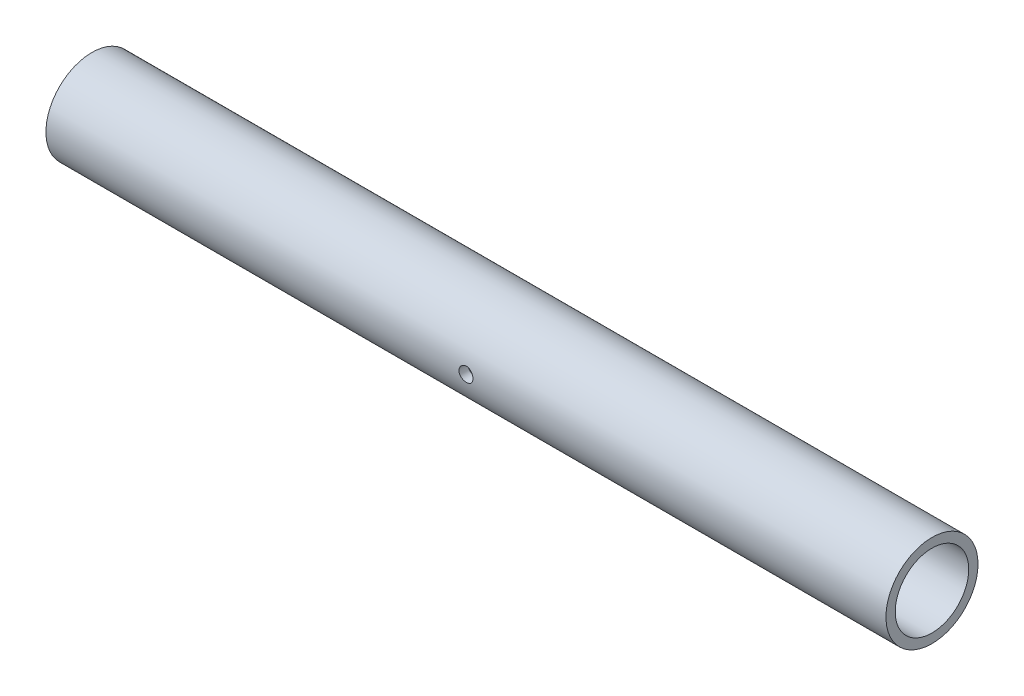
ISO-10303-21;
HEADER;
FILE_DESCRIPTION(('STEP AP214'),'2;1');
FILE_NAME('part.step','',(''),(''),'','','');
FILE_SCHEMA(('AUTOMOTIVE_DESIGN { 1 0 10303 214 1 1 1 1 }'));
ENDSEC;
DATA;
#1=APPLICATION_CONTEXT('core data for automotive mechanical design processes');
#2=APPLICATION_PROTOCOL_DEFINITION('international standard','automotive_design',2000,#1);
#3=PRODUCT_CONTEXT('',#1,'mechanical');
#4=PRODUCT('Part','Part','',(#3));
#5=PRODUCT_RELATED_PRODUCT_CATEGORY('part','',(#4));
#6=PRODUCT_DEFINITION_FORMATION('','',#4);
#7=PRODUCT_DEFINITION_CONTEXT('part definition',#1,'design');
#8=PRODUCT_DEFINITION('design','',#6,#7);
#9=PRODUCT_DEFINITION_SHAPE('','',#8);
#10=(LENGTH_UNIT() NAMED_UNIT(*) SI_UNIT(.MILLI.,.METRE.));
#11=(NAMED_UNIT(*) PLANE_ANGLE_UNIT() SI_UNIT($,.RADIAN.));
#12=(NAMED_UNIT(*) SI_UNIT($,.STERADIAN.) SOLID_ANGLE_UNIT());
#13=UNCERTAINTY_MEASURE_WITH_UNIT(LENGTH_MEASURE(1.E-05),#10,'distance_accuracy_value','');
#14=(GEOMETRIC_REPRESENTATION_CONTEXT(3) GLOBAL_UNCERTAINTY_ASSIGNED_CONTEXT((#13)) GLOBAL_UNIT_ASSIGNED_CONTEXT((#10,
#11,#12)) REPRESENTATION_CONTEXT('',''));
#15=CARTESIAN_POINT('',(0.,0.,0.));
#16=DIRECTION('',(0.,0.,1.));
#17=DIRECTION('',(1.,0.,0.));
#18=AXIS2_PLACEMENT_3D('',#15,#16,#17);
#19=CARTESIAN_POINT('',(304.8,0.,0.));
#20=DIRECTION('',(1.,0.,0.));
#21=DIRECTION('',(0.,0.,-1.));
#22=AXIS2_PLACEMENT_3D('',#19,#20,#21);
#23=PLANE('',#22);
#24=CARTESIAN_POINT('',(304.8,0.,0.));
#25=DIRECTION('',(1.,0.,0.));
#26=DIRECTION('',(0.,0.,-1.));
#27=AXIS2_PLACEMENT_3D('',#24,#25,#26);
#28=CIRCLE('',#27,16.7005);
#29=CARTESIAN_POINT('',(304.8,0.,-16.7005));
#30=VERTEX_POINT('',#29);
#31=EDGE_CURVE('E10',#30,#30,#28,.T.);
#32=ORIENTED_EDGE('',*,*,#31,.T.);
#33=EDGE_LOOP('',(#32));
#34=FACE_BOUND('',#33,.T.);
#35=CARTESIAN_POINT('',(304.8,0.,0.));
#36=DIRECTION('',(1.,0.,0.));
#37=DIRECTION('',(0.,0.,-1.));
#38=AXIS2_PLACEMENT_3D('',#35,#36,#37);
#39=CIRCLE('',#38,13.335);
#40=CARTESIAN_POINT('',(304.8,0.,-13.335));
#41=VERTEX_POINT('',#40);
#42=EDGE_CURVE('E44',#41,#41,#39,.T.);
#43=ORIENTED_EDGE('',*,*,#42,.F.);
#44=EDGE_LOOP('',(#43));
#45=FACE_BOUND('',#44,.T.);
#46=ADVANCED_FACE('F32',(#34,#45),#23,.T.);
#47=CARTESIAN_POINT('',(0.,0.,0.));
#48=DIRECTION('',(1.,0.,0.));
#49=DIRECTION('',(0.,0.,-1.));
#50=AXIS2_PLACEMENT_3D('',#47,#48,#49);
#51=PLANE('',#50);
#52=CARTESIAN_POINT('',(0.,0.,0.));
#53=DIRECTION('',(1.,0.,0.));
#54=DIRECTION('',(0.,0.,-1.));
#55=AXIS2_PLACEMENT_3D('',#52,#53,#54);
#56=CIRCLE('',#55,16.7005);
#57=CARTESIAN_POINT('',(0.,0.,-16.7005));
#58=VERTEX_POINT('',#57);
#59=EDGE_CURVE('E37',#58,#58,#56,.T.);
#60=ORIENTED_EDGE('',*,*,#59,.F.);
#61=EDGE_LOOP('',(#60));
#62=FACE_BOUND('',#61,.T.);
#63=CARTESIAN_POINT('',(0.,0.,0.));
#64=DIRECTION('',(1.,0.,0.));
#65=DIRECTION('',(0.,0.,-1.));
#66=AXIS2_PLACEMENT_3D('',#63,#64,#65);
#67=CIRCLE('',#66,13.335);
#68=CARTESIAN_POINT('',(0.,0.,-13.335));
#69=VERTEX_POINT('',#68);
#70=EDGE_CURVE('E46',#69,#69,#67,.T.);
#71=ORIENTED_EDGE('',*,*,#70,.T.);
#72=EDGE_LOOP('',(#71));
#73=FACE_BOUND('',#72,.T.);
#74=ADVANCED_FACE('F73',(#62,#73),#51,.F.);
#75=CARTESIAN_POINT('',(304.8,0.,0.));
#76=DIRECTION('',(-1.,0.,0.));
#77=DIRECTION('',(0.,0.,1.));
#78=AXIS2_PLACEMENT_3D('',#75,#76,#77);
#79=CYLINDRICAL_SURFACE('',#78,16.7005);
#80=CARTESIAN_POINT('',(154.9527,0.,16.7005));
#81=CARTESIAN_POINT('',(154.952694148685,-0.142495741614808,16.7004976867134));
#82=CARTESIAN_POINT('',(154.940728209795,-0.285073362780954,16.698657155009));
#83=CARTESIAN_POINT('',(154.893194005577,-0.56624111882846,16.6914920623086));
#84=CARTESIAN_POINT('',(154.857602968243,-0.704827271765602,16.6861641399192));
#85=CARTESIAN_POINT('',(154.763908768856,-0.973902530812743,16.6726228172328));
#86=CARTESIAN_POINT('',(154.705822852533,-1.10439775115164,16.6644116278452));
#87=CARTESIAN_POINT('',(154.568830390964,-1.35376975931313,16.646010367155));
#88=CARTESIAN_POINT('',(154.489926653192,-1.47264811081689,16.6358205627356));
#89=CARTESIAN_POINT('',(154.312857595302,-1.69639408857641,16.6145023453034));
#90=CARTESIAN_POINT('',(154.21455689291,-1.80115398997693,16.6033676680795));
#91=CARTESIAN_POINT('',(154.001775649134,-1.99275970465777,16.5814635036606));
#92=CARTESIAN_POINT('',(153.887294163435,-2.0796044716776,16.5706940378251));
#93=CARTESIAN_POINT('',(153.644674563623,-2.23333612031372,16.5506788932135));
#94=CARTESIAN_POINT('',(153.516469439897,-2.30011839277781,16.5414413101584));
#95=CARTESIAN_POINT('',(153.250497230487,-2.41116076239233,16.5256216036892));
#96=CARTESIAN_POINT('',(153.112730686691,-2.45542213471663,16.5190393299311));
#97=CARTESIAN_POINT('',(152.832680790303,-2.51983092083288,16.5093372261092));
#98=CARTESIAN_POINT('',(152.690440849797,-2.54016302478408,16.506190890695));
#99=CARTESIAN_POINT('',(152.404535970859,-2.55670835239973,16.5036364826265));
#100=CARTESIAN_POINT('',(152.260871117857,-2.55292301338208,16.5042281871976));
#101=CARTESIAN_POINT('',(151.977501449171,-2.52149175759947,16.5090587727699));
#102=CARTESIAN_POINT('',(151.837773171075,-2.49405182967903,16.5132661666504));
#103=CARTESIAN_POINT('',(151.564927551711,-2.41641290291032,16.524804859706));
#104=CARTESIAN_POINT('',(151.431810404146,-2.3662132376526,16.5321362503519));
#105=CARTESIAN_POINT('',(151.175340673029,-2.24426646671191,16.5491315276713));
#106=CARTESIAN_POINT('',(151.052030089225,-2.17243239142541,16.5588047972422));
#107=CARTESIAN_POINT('',(150.81913492146,-2.00931781222802,16.5793871607617));
#108=CARTESIAN_POINT('',(150.709551273203,-1.91803598379362,16.5902963388604));
#109=CARTESIAN_POINT('',(150.506027059983,-1.71748772277903,16.6122603243169));
#110=CARTESIAN_POINT('',(150.412260897622,-1.60804424725734,16.6233154669077));
#111=CARTESIAN_POINT('',(150.244399876039,-1.37488203669379,16.6442205373115));
#112=CARTESIAN_POINT('',(150.170305109048,-1.25116323472562,16.6540704594736));
#113=CARTESIAN_POINT('',(150.043880059519,-0.992809023919818,16.6714661376094));
#114=CARTESIAN_POINT('',(149.991563552695,-0.858166769651909,16.6790104343736));
#115=CARTESIAN_POINT('',(149.910333391368,-0.581866429234559,16.6909327089944));
#116=CARTESIAN_POINT('',(149.881418093387,-0.440208836517879,16.6953109092055));
#117=CARTESIAN_POINT('',(149.84804379727,-0.15540384328218,16.7003781628502));
#118=CARTESIAN_POINT('',(149.843345088552,-0.0122851525849659,16.7011033741657));
#119=CARTESIAN_POINT('',(149.857900622412,0.272696097261191,16.6988814632555));
#120=CARTESIAN_POINT('',(149.877154094136,0.414558696686981,16.6959344592128));
#121=CARTESIAN_POINT('',(149.938868112366,0.692272367132334,16.6867216116966));
#122=CARTESIAN_POINT('',(149.981211563134,0.828150062791593,16.6804725189497));
#123=CARTESIAN_POINT('',(150.08777986095,1.09087755943283,16.6653538164498));
#124=CARTESIAN_POINT('',(150.152005769528,1.21772692208387,16.6564840795706));
#125=CARTESIAN_POINT('',(150.301076026137,1.45984892681212,16.6370196365877));
#126=CARTESIAN_POINT('',(150.386072051791,1.57502716085383,16.6264124393314));
#127=CARTESIAN_POINT('',(150.574059059338,1.78957030044293,16.6046917393545));
#128=CARTESIAN_POINT('',(150.677051129439,1.88893424901711,16.5935782060463));
#129=CARTESIAN_POINT('',(150.899175137503,2.06990315113865,16.5719823718543));
#130=CARTESIAN_POINT('',(151.018438869227,2.15134720389298,16.5615063563669));
#131=CARTESIAN_POINT('',(151.269095043549,2.29304514159802,16.5424840027995));
#132=CARTESIAN_POINT('',(151.400487148527,2.35329961618331,16.5339376110269));
#133=CARTESIAN_POINT('',(151.671195450696,2.45066004328359,16.5197879354036));
#134=CARTESIAN_POINT('',(151.810480884563,2.4878499149827,16.5141739939145));
#135=CARTESIAN_POINT('',(152.093413173411,2.53829207476794,16.5064967707241));
#136=CARTESIAN_POINT('',(152.237059713836,2.55154608513676,16.5044332335573));
#137=CARTESIAN_POINT('',(152.523032407778,2.55369815360237,16.5041002435876));
#138=CARTESIAN_POINT('',(152.665356675606,2.54284924350765,16.5057913742589));
#139=CARTESIAN_POINT('',(152.946130923917,2.49764646979545,16.5126913892346));
#140=CARTESIAN_POINT('',(153.084580911575,2.46329264971225,16.5179002670237));
#141=CARTESIAN_POINT('',(153.353601826018,2.37214595380091,16.5312348886822));
#142=CARTESIAN_POINT('',(153.484179099745,2.31537143996926,16.5393582451685));
#143=CARTESIAN_POINT('',(153.733995981226,2.18102027316627,16.5576093287388));
#144=CARTESIAN_POINT('',(153.853235175235,2.1034428614564,16.5677371289268));
#145=CARTESIAN_POINT('',(154.078275553688,1.92877138400066,16.5889823953652));
#146=CARTESIAN_POINT('',(154.183930610837,1.83149011012819,16.6001087367033));
#147=CARTESIAN_POINT('',(154.377505811123,1.6205680011597,16.6220238827646));
#148=CARTESIAN_POINT('',(154.465421832014,1.50692337399104,16.6328126085407));
#149=CARTESIAN_POINT('',(154.621475099668,1.26573322100042,16.6529077042466));
#150=CARTESIAN_POINT('',(154.689496175157,1.13811180318665,16.662205229733));
#151=CARTESIAN_POINT('',(154.803034775807,0.873171990993248,16.6781837699746));
#152=CARTESIAN_POINT('',(154.848575461957,0.735863744164259,16.6848674762014));
#153=CARTESIAN_POINT('',(154.905602009183,0.498293942562698,16.6933505985302));
#154=CARTESIAN_POINT('',(154.923236553761,0.399494249657639,16.6960177634322));
#155=CARTESIAN_POINT('',(154.946787530569,0.200476536562219,16.6995932664026));
#156=CARTESIAN_POINT('',(154.952704116925,0.100258535044429,16.7005016276046));
#157=CARTESIAN_POINT('',(154.9527,0.,16.7005));
#158=B_SPLINE_CURVE_WITH_KNOTS('',3,(#80,#81,#82,#83,#84,#85,#86,#87,#88,#89,#90,#91,#92,#93,
#94,#95,#96,#97,#98,#99,#100,#101,#102,#103,#104,#105,#106,#107,#108,#109,#110,#111,#112,#113,
#114,#115,#116,#117,#118,#119,#120,#121,#122,#123,#124,#125,#126,#127,#128,#129,#130,#131,#132,
#133,#134,#135,#136,#137,#138,#139,#140,#141,#142,#143,#144,#145,#146,#147,#148,#149,#150,#151,
#152,#153,#154,#155,#156,#157),.UNSPECIFIED.,.T.,.F.,(4,2,2,2,2,2,2,2,2,2,2,2,2,2,2,2,2,2,2,2,2,
2,2,2,2,2,2,2,2,2,2,2,2,2,2,2,2,2,4),(0.,0.427120850123167,0.854653996926453,1.28186002165463,
1.70900846315275,2.13925097672643,2.56951860975402,3.00199227159855,3.43444144328115,
3.86353054233216,4.29259406936566,4.71795854161827,5.14333546942823,5.57044575550799,
5.99758513999142,6.4291634842538,6.86074385194585,7.29259679998682,7.72441941612234,
8.15195926429043,8.57948535328662,9.00486323287765,9.43026175074956,9.85886487116816,
10.2874939178853,10.7198273230551,11.1521486968905,11.5828877223658,12.0135957531794,
12.4398036098952,12.8660106772182,13.2918694129212,13.7177436829692,14.147871938876,
14.5781000343813,15.0107923508466,15.443037939831,15.743559720296,16.0440775479518),.UNSPECIFIED.);
#159=CARTESIAN_POINT('',(154.9527,0.,16.7005));
#160=VERTEX_POINT('',#159);
#161=EDGE_CURVE('E49',#160,#160,#158,.T.);
#162=ORIENTED_EDGE('',*,*,#161,.T.);
#163=EDGE_LOOP('',(#162));
#164=FACE_BOUND('',#163,.T.);
#165=ORIENTED_EDGE('',*,*,#31,.F.);
#166=EDGE_LOOP('',(#165));
#167=FACE_BOUND('',#166,.T.);
#168=ORIENTED_EDGE('',*,*,#59,.T.);
#169=EDGE_LOOP('',(#168));
#170=FACE_BOUND('',#169,.T.);
#171=ADVANCED_FACE('F34',(#164,#167,#170),#79,.T.);
#172=CARTESIAN_POINT('',(304.8,0.,0.));
#173=DIRECTION('',(-1.,0.,0.));
#174=DIRECTION('',(0.,0.,1.));
#175=AXIS2_PLACEMENT_3D('',#172,#173,#174);
#176=CYLINDRICAL_SURFACE('',#175,13.335);
#177=CARTESIAN_POINT('',(154.9527,0.,13.335));
#178=CARTESIAN_POINT('',(154.952694633969,-0.141996506763978,13.3349974108733));
#179=CARTESIAN_POINT('',(154.940811916449,-0.284062211548814,13.3327085704285));
#180=CARTESIAN_POINT('',(154.893627805119,-0.564186510046626,13.3237985935968));
#181=CARTESIAN_POINT('',(154.858307003428,-0.702241683874888,13.3171738669461));
#182=CARTESIAN_POINT('',(154.765370941577,-0.970253538037561,13.3003327731445));
#183=CARTESIAN_POINT('',(154.707776192586,-1.10021754174126,13.2901197111347));
#184=CARTESIAN_POINT('',(154.571986211121,-1.34862666841281,13.2672156603168));
#185=CARTESIAN_POINT('',(154.493792509817,-1.46707264664783,13.2545248557035));
#186=CARTESIAN_POINT('',(154.317990526751,-1.69057022244865,13.2278880534064));
#187=CARTESIAN_POINT('',(154.220175319793,-1.79545758937839,13.213929628508));
#188=CARTESIAN_POINT('',(154.008351972904,-1.98743941735015,13.1864224572463));
#189=CARTESIAN_POINT('',(153.894342640317,-2.07453256673938,13.1728737411462));
#190=CARTESIAN_POINT('',(153.652200334093,-2.2291416999098,13.1475990622031));
#191=CARTESIAN_POINT('',(153.523958282867,-2.29648969944411,13.1358891122937));
#192=CARTESIAN_POINT('',(153.257718022459,-2.40862115810106,13.115793345128));
#193=CARTESIAN_POINT('',(153.119720693318,-2.45340664967142,13.1074072284727));
#194=CARTESIAN_POINT('',(152.839647393008,-2.51861284372904,13.0950339182917));
#195=CARTESIAN_POINT('',(152.697640561605,-2.53932049608294,13.0909949611783));
#196=CARTESIAN_POINT('',(152.412115150598,-2.55667406430123,13.0876172920902));
#197=CARTESIAN_POINT('',(152.268596713637,-2.55332223058332,13.0882781405163));
#198=CARTESIAN_POINT('',(151.986207246722,-2.52288444363947,13.0941783166969));
#199=CARTESIAN_POINT('',(151.847299445034,-2.4961255990724,13.0993545401827));
#200=CARTESIAN_POINT('',(151.575981866996,-2.42014888618961,13.1136030422845));
#201=CARTESIAN_POINT('',(151.443572377627,-2.37093002697313,13.1226754927947));
#202=CARTESIAN_POINT('',(151.188057380545,-2.2511128596095,13.1437597327899));
#203=CARTESIAN_POINT('',(151.065015002077,-2.18038321807219,13.1557894889995));
#204=CARTESIAN_POINT('',(150.832422052206,-2.01964505648578,13.1814211169073));
#205=CARTESIAN_POINT('',(150.722872907952,-1.92963449989332,13.1950231546076));
#206=CARTESIAN_POINT('',(150.518486927355,-1.73112971738714,13.2225412156518));
#207=CARTESIAN_POINT('',(150.423921638675,-1.62235588887621,13.2364587241452));
#208=CARTESIAN_POINT('',(150.254338766094,-1.39034586687605,13.2628342501336));
#209=CARTESIAN_POINT('',(150.179321394257,-1.26710951651289,13.2752922517945));
#210=CARTESIAN_POINT('',(150.050920679267,-1.00938376970615,13.2973718655304));
#211=CARTESIAN_POINT('',(149.997566439385,-0.874879525983183,13.3069896572376));
#212=CARTESIAN_POINT('',(149.914285665102,-0.598592330817632,13.3222758357339));
#213=CARTESIAN_POINT('',(149.884356534819,-0.456810187740462,13.3279446601251));
#214=CARTESIAN_POINT('',(149.849155517806,-0.172327253954929,13.3346338153584));
#215=CARTESIAN_POINT('',(149.843511707102,-0.0296740798146362,13.3357242567181));
#216=CARTESIAN_POINT('',(149.856042659816,0.254537380888736,13.3333277792285));
#217=CARTESIAN_POINT('',(149.874216201312,0.39609572324611,13.3298410952034));
#218=CARTESIAN_POINT('',(149.933556825576,0.672913302390481,13.3187258596383));
#219=CARTESIAN_POINT('',(149.974534901926,0.808214543072742,13.3111313683722));
#220=CARTESIAN_POINT('',(150.078116229078,1.07002609022541,13.292648666225));
#221=CARTESIAN_POINT('',(150.140720996045,1.19653577960608,13.2817602244241));
#222=CARTESIAN_POINT('',(150.286596038247,1.43875460145297,13.2577225681211));
#223=CARTESIAN_POINT('',(150.370092545412,1.55432503263741,13.2445491233837));
#224=CARTESIAN_POINT('',(150.555075770465,1.76994760666978,13.2174634877171));
#225=CARTESIAN_POINT('',(150.656564244428,1.86999823294405,13.2035512247698));
#226=CARTESIAN_POINT('',(150.876337220712,2.05316122371925,13.1763222036819));
#227=CARTESIAN_POINT('',(150.994835236956,2.13601929845185,13.1630163870002));
#228=CARTESIAN_POINT('',(151.244286306356,2.2806548677371,13.1387305003644));
#229=CARTESIAN_POINT('',(151.375238884693,2.34243316552856,13.1277503417978));
#230=CARTESIAN_POINT('',(151.645249390601,2.44279908861991,13.1094456242196));
#231=CARTESIAN_POINT('',(151.784263463796,2.48150125183952,13.1021030414483));
#232=CARTESIAN_POINT('',(152.066975552265,2.53496780085313,13.0918645522918));
#233=CARTESIAN_POINT('',(152.210673011961,2.54973501552433,13.0889681204172));
#234=CARTESIAN_POINT('',(152.496123884491,2.55481471354808,13.0879773120553));
#235=CARTESIAN_POINT('',(152.637870036468,2.54552852246462,13.0898041283237));
#236=CARTESIAN_POINT('',(152.917740635518,2.50364583305089,13.0978788233106));
#237=CARTESIAN_POINT('',(153.055865106433,2.47104948822017,13.1041266729161));
#238=CARTESIAN_POINT('',(153.324343456403,2.38364413001376,13.1203056364873));
#239=CARTESIAN_POINT('',(153.454712542945,2.3288803500682,13.1302292464535));
#240=CARTESIAN_POINT('',(153.704475947967,2.19873920384338,13.1526465702537));
#241=CARTESIAN_POINT('',(153.8238694451,2.12336029652824,13.1651404762069));
#242=CARTESIAN_POINT('',(154.050299188428,1.95274092599978,13.1915341995428));
#243=CARTESIAN_POINT('',(154.157113703956,1.85720907348387,13.2054529024313));
#244=CARTESIAN_POINT('',(154.353329579334,1.64960141498796,13.2329884318782));
#245=CARTESIAN_POINT('',(154.442726933971,1.53752181411409,13.2466051883651));
#246=CARTESIAN_POINT('',(154.602362395046,1.29873057860315,13.2721537074263));
#247=CARTESIAN_POINT('',(154.672411558093,1.17189073720602,13.2840683396399));
#248=CARTESIAN_POINT('',(154.790092511197,0.908052776572236,13.3047025065956));
#249=CARTESIAN_POINT('',(154.837745096968,0.771064218035205,13.3134250036326));
#250=CARTESIAN_POINT('',(154.899741585669,0.528084628327944,13.3249394864456));
#251=CARTESIAN_POINT('',(154.919566603084,0.423502978214505,13.3286906366648));
#252=CARTESIAN_POINT('',(154.946047639583,0.212627122098883,13.3337218291228));
#253=CARTESIAN_POINT('',(154.95270401831,0.106332962946133,13.3350019388471));
#254=CARTESIAN_POINT('',(154.9527,0.,13.335));
#255=B_SPLINE_CURVE_WITH_KNOTS('',3,(#177,#178,#179,#180,#181,#182,#183,#184,#185,#186,#187,
#188,#189,#190,#191,#192,#193,#194,#195,#196,#197,#198,#199,#200,#201,#202,#203,#204,#205,#206,
#207,#208,#209,#210,#211,#212,#213,#214,#215,#216,#217,#218,#219,#220,#221,#222,#223,#224,#225,
#226,#227,#228,#229,#230,#231,#232,#233,#234,#235,#236,#237,#238,#239,#240,#241,#242,#243,#244,
#245,#246,#247,#248,#249,#250,#251,#252,#253,#254),.UNSPECIFIED.,.T.,.F.,(4,2,2,2,2,2,2,2,2,2,2,
2,2,2,2,2,2,2,2,2,2,2,2,2,2,2,2,2,2,2,2,2,2,2,2,2,2,2,4),(0.,0.425600613737914,0.85155408612264,
1.27711624573684,1.70264678120477,2.13292616905738,2.56323726236185,2.99710957802963,
3.43094280316049,3.85955099983972,4.28811910693016,4.71079204965321,5.13348364184919,
5.55880961532156,5.98418053594911,6.41654615887456,6.84891647207247,7.28186574510059,
7.71476703352634,8.1410144010929,8.56723990138779,8.98998430835654,9.41275835836335,
9.84032525504212,10.2679339066766,10.7014758469292,11.1350012653463,11.5663565788308,
11.9976609066108,12.4218155481153,12.8459673965472,13.2692580765123,13.6925804072401,
14.1225039853577,14.5525263114029,14.9866103907744,15.420290613363,15.739006977027,
16.057714636263),.UNSPECIFIED.);
#256=CARTESIAN_POINT('',(154.9527,0.,13.335));
#257=VERTEX_POINT('',#256);
#258=EDGE_CURVE('E57',#257,#257,#255,.T.);
#259=ORIENTED_EDGE('',*,*,#258,.F.);
#260=EDGE_LOOP('',(#259));
#261=FACE_BOUND('',#260,.T.);
#262=ORIENTED_EDGE('',*,*,#42,.T.);
#263=EDGE_LOOP('',(#262));
#264=FACE_BOUND('',#263,.T.);
#265=ORIENTED_EDGE('',*,*,#70,.F.);
#266=EDGE_LOOP('',(#265));
#267=FACE_BOUND('',#266,.T.);
#268=ADVANCED_FACE('F64',(#261,#264,#267),#176,.F.);
#269=CARTESIAN_POINT('',(152.4,0.,16.7005));
#270=DIRECTION('',(0.,0.,1.));
#271=DIRECTION('',(1.,0.,0.));
#272=AXIS2_PLACEMENT_3D('',#269,#270,#271);
#273=CYLINDRICAL_SURFACE('',#272,2.55269999999999);
#274=ORIENTED_EDGE('',*,*,#258,.T.);
#275=EDGE_LOOP('',(#274));
#276=FACE_BOUND('',#275,.T.);
#277=ORIENTED_EDGE('',*,*,#161,.F.);
#278=EDGE_LOOP('',(#277));
#279=FACE_BOUND('',#278,.T.);
#280=ADVANCED_FACE('F61',(#276,#279),#273,.F.);
#281=CLOSED_SHELL('',(#46,#74,#171,#268,#280));
#282=MANIFOLD_SOLID_BREP('B2',#281);
#283=ADVANCED_BREP_SHAPE_REPRESENTATION('',(#18,#282),#14);
#284=SHAPE_DEFINITION_REPRESENTATION(#9,#283);
ENDSEC;
END-ISO-10303-21;
